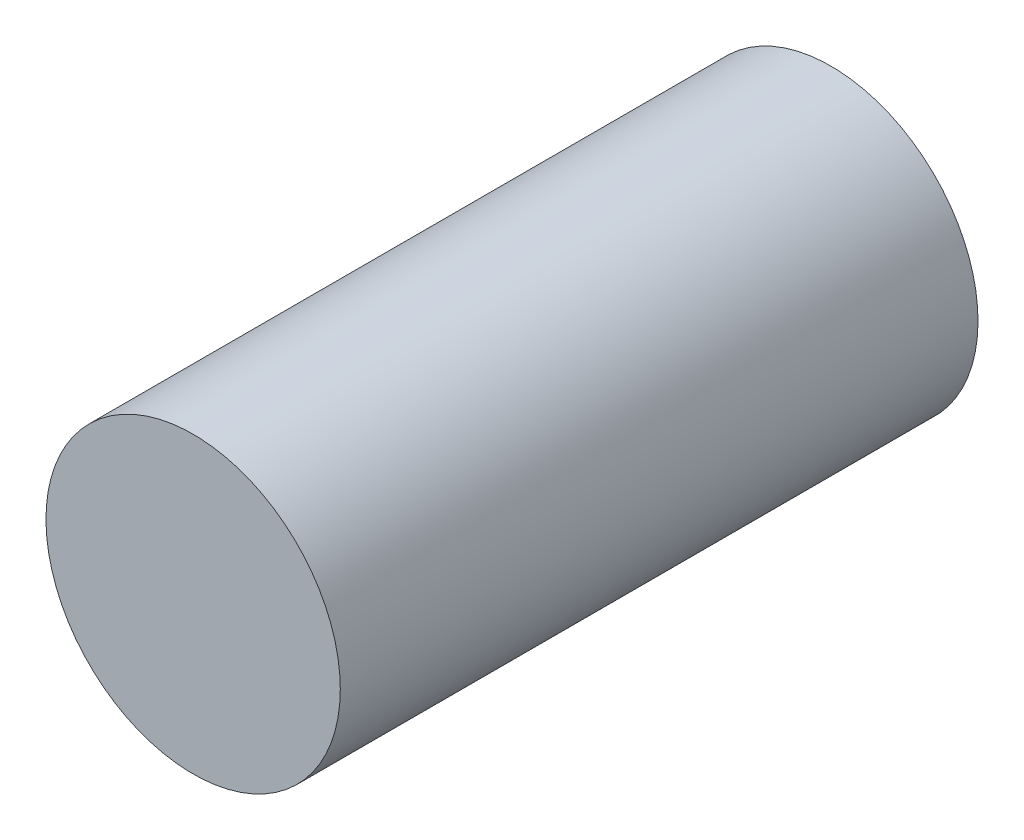
ISO-10303-21;
HEADER;
FILE_DESCRIPTION(('STEP AP214'),'2;1');
FILE_NAME('part.step','',(''),(''),'','','');
FILE_SCHEMA(('AUTOMOTIVE_DESIGN { 1 0 10303 214 1 1 1 1 }'));
ENDSEC;
DATA;
#1=APPLICATION_CONTEXT('core data for automotive mechanical design processes');
#2=APPLICATION_PROTOCOL_DEFINITION('international standard','automotive_design',2000,#1);
#3=PRODUCT_CONTEXT('',#1,'mechanical');
#4=PRODUCT('Part','Part','',(#3));
#5=PRODUCT_RELATED_PRODUCT_CATEGORY('part','',(#4));
#6=PRODUCT_DEFINITION_FORMATION('','',#4);
#7=PRODUCT_DEFINITION_CONTEXT('part definition',#1,'design');
#8=PRODUCT_DEFINITION('design','',#6,#7);
#9=PRODUCT_DEFINITION_SHAPE('','',#8);
#10=(LENGTH_UNIT() NAMED_UNIT(*) SI_UNIT(.MILLI.,.METRE.));
#11=(NAMED_UNIT(*) PLANE_ANGLE_UNIT() SI_UNIT($,.RADIAN.));
#12=(NAMED_UNIT(*) SI_UNIT($,.STERADIAN.) SOLID_ANGLE_UNIT());
#13=UNCERTAINTY_MEASURE_WITH_UNIT(LENGTH_MEASURE(1.E-05),#10,'distance_accuracy_value','');
#14=(GEOMETRIC_REPRESENTATION_CONTEXT(3) GLOBAL_UNCERTAINTY_ASSIGNED_CONTEXT((#13)) GLOBAL_UNIT_ASSIGNED_CONTEXT((#10,
#11,#12)) REPRESENTATION_CONTEXT('',''));
#15=CARTESIAN_POINT('',(0.,0.,0.));
#16=DIRECTION('',(0.,0.,1.));
#17=DIRECTION('',(1.,0.,0.));
#18=AXIS2_PLACEMENT_3D('',#15,#16,#17);
#19=CARTESIAN_POINT('',(0.,0.,13.));
#20=DIRECTION('',(0.,0.,-1.));
#21=DIRECTION('',(-1.,0.,0.));
#22=AXIS2_PLACEMENT_3D('',#19,#20,#21);
#23=CYLINDRICAL_SURFACE('',#22,3.);
#24=CARTESIAN_POINT('',(0.,0.,13.));
#25=DIRECTION('',(0.,0.,1.));
#26=DIRECTION('',(1.,0.,0.));
#27=AXIS2_PLACEMENT_3D('',#24,#25,#26);
#28=CIRCLE('',#27,3.);
#29=CARTESIAN_POINT('',(3.,0.,13.));
#30=VERTEX_POINT('',#29);
#31=EDGE_CURVE('E66',#30,#30,#28,.T.);
#32=ORIENTED_EDGE('',*,*,#31,.F.);
#33=EDGE_LOOP('',(#32));
#34=FACE_BOUND('',#33,.T.);
#35=CARTESIAN_POINT('',(0.,0.,9.));
#36=DIRECTION('',(0.,0.,1.));
#37=DIRECTION('',(1.,0.,0.));
#38=AXIS2_PLACEMENT_3D('',#35,#36,#37);
#39=CIRCLE('',#38,3.);
#40=CARTESIAN_POINT('',(-1.59637088422459,-2.54,9.));
#41=VERTEX_POINT('',#40);
#42=CARTESIAN_POINT('',(1.59637088422459,-2.54,9.));
#43=VERTEX_POINT('',#42);
#44=EDGE_CURVE('E11',#41,#43,#39,.T.);
#45=ORIENTED_EDGE('',*,*,#44,.T.);
#46=DIRECTION('',(0.,0.,-1.));
#47=VECTOR('',#46,1.);
#48=CARTESIAN_POINT('',(1.59637088422459,-2.54,9.));
#49=LINE('',#48,#47);
#50=CARTESIAN_POINT('',(1.59637088422459,-2.54,0.));
#51=VERTEX_POINT('',#50);
#52=EDGE_CURVE('E55',#43,#51,#49,.T.);
#53=ORIENTED_EDGE('',*,*,#52,.T.);
#54=CARTESIAN_POINT('',(0.,0.,0.));
#55=DIRECTION('',(0.,0.,1.));
#56=DIRECTION('',(1.,0.,0.));
#57=AXIS2_PLACEMENT_3D('',#54,#55,#56);
#58=CIRCLE('',#57,3.);
#59=CARTESIAN_POINT('',(-1.59637088422459,-2.54,0.));
#60=VERTEX_POINT('',#59);
#61=EDGE_CURVE('E42',#51,#60,#58,.T.);
#62=ORIENTED_EDGE('',*,*,#61,.T.);
#63=DIRECTION('',(0.,0.,-1.));
#64=VECTOR('',#63,1.);
#65=CARTESIAN_POINT('',(-1.59637088422459,-2.54,9.));
#66=LINE('',#65,#64);
#67=EDGE_CURVE('E49',#41,#60,#66,.T.);
#68=ORIENTED_EDGE('',*,*,#67,.F.);
#69=EDGE_LOOP('',(#45,#53,#62,#68));
#70=FACE_BOUND('',#69,.T.);
#71=ADVANCED_FACE('F35',(#34,#70),#23,.T.);
#72=CARTESIAN_POINT('',(0.,0.,0.));
#73=DIRECTION('',(0.,0.,1.));
#74=DIRECTION('',(1.,0.,0.));
#75=AXIS2_PLACEMENT_3D('',#72,#73,#74);
#76=PLANE('',#75);
#77=ORIENTED_EDGE('',*,*,#61,.F.);
#78=DIRECTION('',(1.,0.,0.));
#79=VECTOR('',#78,1.);
#80=CARTESIAN_POINT('',(1.59637088422459,-2.54,0.));
#81=LINE('',#80,#79);
#82=EDGE_CURVE('E60',#60,#51,#81,.T.);
#83=ORIENTED_EDGE('',*,*,#82,.F.);
#84=EDGE_LOOP('',(#77,#83));
#85=FACE_BOUND('',#84,.T.);
#86=ADVANCED_FACE('F70',(#85),#76,.F.);
#87=CARTESIAN_POINT('',(0.,0.,9.));
#88=DIRECTION('',(0.,0.,1.));
#89=DIRECTION('',(1.,0.,0.));
#90=AXIS2_PLACEMENT_3D('',#87,#88,#89);
#91=PLANE('',#90);
#92=DIRECTION('',(1.,0.,0.));
#93=VECTOR('',#92,1.);
#94=CARTESIAN_POINT('',(1.59637088422459,-2.54,9.));
#95=LINE('',#94,#93);
#96=EDGE_CURVE('E65',#41,#43,#95,.T.);
#97=ORIENTED_EDGE('',*,*,#96,.T.);
#98=ORIENTED_EDGE('',*,*,#44,.F.);
#99=EDGE_LOOP('',(#97,#98));
#100=FACE_BOUND('',#99,.T.);
#101=ADVANCED_FACE('F83',(#100),#91,.F.);
#102=CARTESIAN_POINT('',(1.59637088422459,-2.54,9.));
#103=DIRECTION('',(0.,1.,0.));
#104=DIRECTION('',(0.,0.,1.));
#105=AXIS2_PLACEMENT_3D('',#102,#103,#104);
#106=PLANE('',#105);
#107=ORIENTED_EDGE('',*,*,#82,.T.);
#108=ORIENTED_EDGE('',*,*,#52,.F.);
#109=ORIENTED_EDGE('',*,*,#96,.F.);
#110=ORIENTED_EDGE('',*,*,#67,.T.);
#111=EDGE_LOOP('',(#107,#108,#109,#110));
#112=FACE_BOUND('',#111,.T.);
#113=ADVANCED_FACE('F61',(#112),#106,.F.);
#114=CARTESIAN_POINT('',(0.,0.,13.));
#115=DIRECTION('',(0.,0.,1.));
#116=DIRECTION('',(1.,0.,0.));
#117=AXIS2_PLACEMENT_3D('',#114,#115,#116);
#118=PLANE('',#117);
#119=ORIENTED_EDGE('',*,*,#31,.T.);
#120=EDGE_LOOP('',(#119));
#121=FACE_BOUND('',#120,.T.);
#122=ADVANCED_FACE('F77',(#121),#118,.T.);
#123=CLOSED_SHELL('',(#71,#86,#101,#113,#122));
#124=MANIFOLD_SOLID_BREP('B2',#123);
#125=ADVANCED_BREP_SHAPE_REPRESENTATION('',(#18,#124),#14);
#126=SHAPE_DEFINITION_REPRESENTATION(#9,#125);
ENDSEC;
END-ISO-10303-21;
